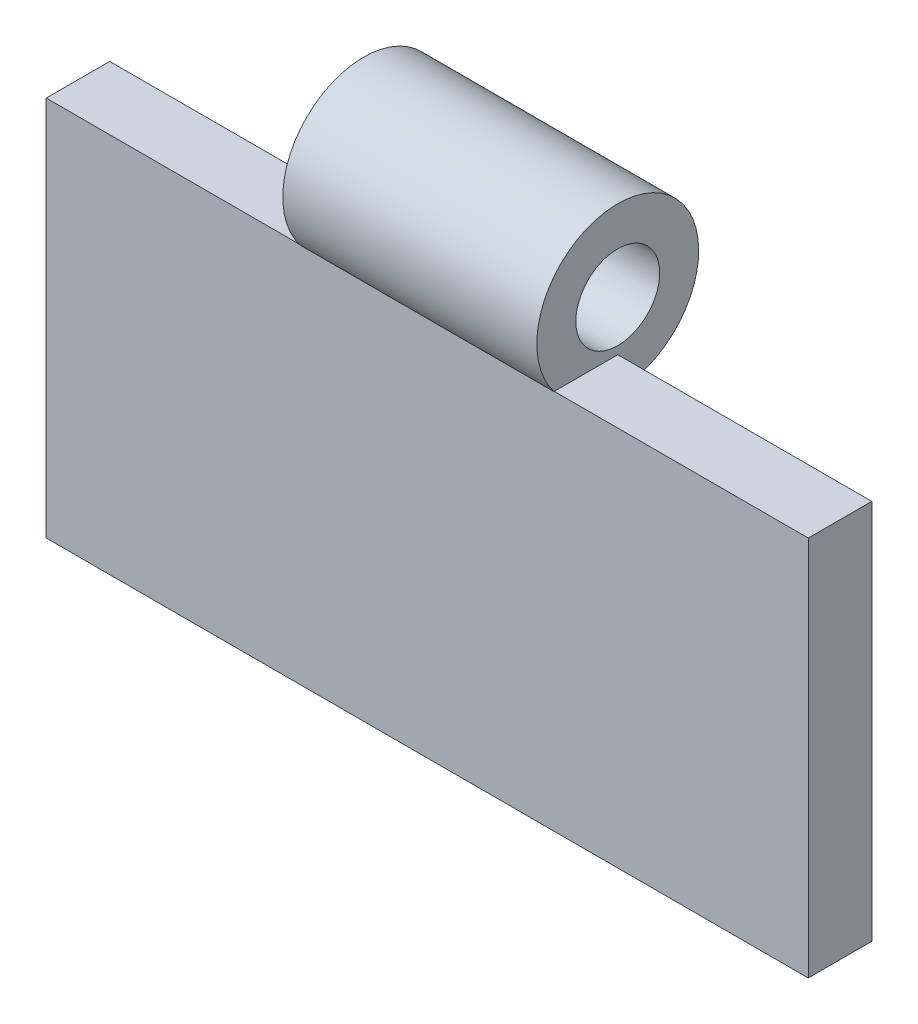
ISO-10303-21;
HEADER;
FILE_DESCRIPTION(('STEP AP214'),'2;1');
FILE_NAME('part.step','',(''),(''),'','','');
FILE_SCHEMA(('AUTOMOTIVE_DESIGN { 1 0 10303 214 1 1 1 1 }'));
ENDSEC;
DATA;
#1=APPLICATION_CONTEXT('core data for automotive mechanical design processes');
#2=APPLICATION_PROTOCOL_DEFINITION('international standard','automotive_design',2000,#1);
#3=PRODUCT_CONTEXT('',#1,'mechanical');
#4=PRODUCT('Part','Part','',(#3));
#5=PRODUCT_RELATED_PRODUCT_CATEGORY('part','',(#4));
#6=PRODUCT_DEFINITION_FORMATION('','',#4);
#7=PRODUCT_DEFINITION_CONTEXT('part definition',#1,'design');
#8=PRODUCT_DEFINITION('design','',#6,#7);
#9=PRODUCT_DEFINITION_SHAPE('','',#8);
#10=(LENGTH_UNIT() NAMED_UNIT(*) SI_UNIT(.MILLI.,.METRE.));
#11=(NAMED_UNIT(*) PLANE_ANGLE_UNIT() SI_UNIT($,.RADIAN.));
#12=(NAMED_UNIT(*) SI_UNIT($,.STERADIAN.) SOLID_ANGLE_UNIT());
#13=UNCERTAINTY_MEASURE_WITH_UNIT(LENGTH_MEASURE(1.E-05),#10,'distance_accuracy_value','');
#14=(GEOMETRIC_REPRESENTATION_CONTEXT(3) GLOBAL_UNCERTAINTY_ASSIGNED_CONTEXT((#13)) GLOBAL_UNIT_ASSIGNED_CONTEXT((#10,
#11,#12)) REPRESENTATION_CONTEXT('',''));
#15=CARTESIAN_POINT('',(0.,0.,0.));
#16=DIRECTION('',(0.,0.,1.));
#17=DIRECTION('',(1.,0.,0.));
#18=AXIS2_PLACEMENT_3D('',#15,#16,#17);
#19=CARTESIAN_POINT('',(0.,0.,5.));
#20=DIRECTION('',(0.,-1.,0.));
#21=DIRECTION('',(0.,0.,-1.));
#22=AXIS2_PLACEMENT_3D('',#19,#20,#21);
#23=PLANE('',#22);
#24=DIRECTION('',(0.,0.,-1.));
#25=VECTOR('',#24,1.);
#26=CARTESIAN_POINT('',(40.,0.,5.));
#27=LINE('',#26,#25);
#28=CARTESIAN_POINT('',(40.,0.,5.));
#29=VERTEX_POINT('',#28);
#30=CARTESIAN_POINT('',(40.,0.,0.));
#31=VERTEX_POINT('',#30);
#32=EDGE_CURVE('E115',#29,#31,#27,.T.);
#33=ORIENTED_EDGE('',*,*,#32,.F.);
#34=DIRECTION('',(-1.,0.,0.));
#35=VECTOR('',#34,1.);
#36=CARTESIAN_POINT('',(0.,0.,5.));
#37=LINE('',#36,#35);
#38=CARTESIAN_POINT('',(60.,0.,5.));
#39=VERTEX_POINT('',#38);
#40=EDGE_CURVE('E145',#39,#29,#37,.T.);
#41=ORIENTED_EDGE('',*,*,#40,.F.);
#42=DIRECTION('',(0.,0.,-1.));
#43=VECTOR('',#42,1.);
#44=CARTESIAN_POINT('',(60.,0.,5.));
#45=LINE('',#44,#43);
#46=CARTESIAN_POINT('',(60.,0.,0.));
#47=VERTEX_POINT('',#46);
#48=EDGE_CURVE('E154',#39,#47,#45,.T.);
#49=ORIENTED_EDGE('',*,*,#48,.T.);
#50=DIRECTION('',(-1.,0.,0.));
#51=VECTOR('',#50,1.);
#52=CARTESIAN_POINT('',(0.,0.,0.));
#53=LINE('',#52,#51);
#54=EDGE_CURVE('E141',#47,#31,#53,.T.);
#55=ORIENTED_EDGE('',*,*,#54,.T.);
#56=EDGE_LOOP('',(#33,#41,#49,#55));
#57=FACE_BOUND('',#56,.T.);
#58=ADVANCED_FACE('F39',(#57),#23,.F.);
#59=CARTESIAN_POINT('',(0.,0.,5.));
#60=DIRECTION('',(0.,0.,1.));
#61=DIRECTION('',(1.,0.,0.));
#62=AXIS2_PLACEMENT_3D('',#59,#60,#61);
#63=PLANE('',#62);
#64=ORIENTED_EDGE('',*,*,#40,.T.);
#65=DIRECTION('',(0.,-1.,0.));
#66=VECTOR('',#65,1.);
#67=CARTESIAN_POINT('',(40.,0.,5.));
#68=LINE('',#67,#66);
#69=CARTESIAN_POINT('',(40.,-0.0302785370189405,5.));
#70=VERTEX_POINT('',#69);
#71=EDGE_CURVE('E130',#29,#70,#68,.T.);
#72=ORIENTED_EDGE('',*,*,#71,.T.);
#73=DIRECTION('',(-1.,0.,0.));
#74=VECTOR('',#73,1.);
#75=CARTESIAN_POINT('',(40.,-0.0302785370189405,5.));
#76=LINE('',#75,#74);
#77=CARTESIAN_POINT('',(20.,-0.0302785370189405,5.));
#78=VERTEX_POINT('',#77);
#79=EDGE_CURVE('E120',#78,#70,#76,.F.);
#80=ORIENTED_EDGE('',*,*,#79,.F.);
#81=DIRECTION('',(0.,-1.,0.));
#82=VECTOR('',#81,1.);
#83=CARTESIAN_POINT('',(20.,0.,5.));
#84=LINE('',#83,#82);
#85=CARTESIAN_POINT('',(20.,0.,5.));
#86=VERTEX_POINT('',#85);
#87=EDGE_CURVE('E111',#86,#78,#84,.T.);
#88=ORIENTED_EDGE('',*,*,#87,.F.);
#89=CARTESIAN_POINT('',(0.,0.,5.));
#90=VERTEX_POINT('',#89);
#91=EDGE_CURVE('E63',#86,#90,#37,.T.);
#92=ORIENTED_EDGE('',*,*,#91,.T.);
#93=DIRECTION('',(0.,-1.,0.));
#94=VECTOR('',#93,1.);
#95=CARTESIAN_POINT('',(0.,0.,5.));
#96=LINE('',#95,#94);
#97=CARTESIAN_POINT('',(0.,-30.,5.));
#98=VERTEX_POINT('',#97);
#99=EDGE_CURVE('E139',#90,#98,#96,.T.);
#100=ORIENTED_EDGE('',*,*,#99,.T.);
#101=DIRECTION('',(1.,0.,0.));
#102=VECTOR('',#101,1.);
#103=CARTESIAN_POINT('',(0.,-30.,5.));
#104=LINE('',#103,#102);
#105=CARTESIAN_POINT('',(60.,-30.,5.));
#106=VERTEX_POINT('',#105);
#107=EDGE_CURVE('E93',#98,#106,#104,.T.);
#108=ORIENTED_EDGE('',*,*,#107,.T.);
#109=DIRECTION('',(0.,1.,0.));
#110=VECTOR('',#109,1.);
#111=CARTESIAN_POINT('',(60.,0.,5.));
#112=LINE('',#111,#110);
#113=EDGE_CURVE('E143',#106,#39,#112,.T.);
#114=ORIENTED_EDGE('',*,*,#113,.T.);
#115=EDGE_LOOP('',(#64,#72,#80,#88,#92,#100,#108,#114));
#116=FACE_BOUND('',#115,.T.);
#117=ADVANCED_FACE('F129',(#116),#63,.T.);
#118=CARTESIAN_POINT('',(0.,0.,0.));
#119=DIRECTION('',(0.,0.,1.));
#120=DIRECTION('',(1.,0.,0.));
#121=AXIS2_PLACEMENT_3D('',#118,#119,#120);
#122=PLANE('',#121);
#123=DIRECTION('',(0.,-1.,0.));
#124=VECTOR('',#123,1.);
#125=CARTESIAN_POINT('',(40.,0.,0.));
#126=LINE('',#125,#124);
#127=CARTESIAN_POINT('',(40.,-2.45052575586928,0.));
#128=VERTEX_POINT('',#127);
#129=EDGE_CURVE('E12',#31,#128,#126,.T.);
#130=ORIENTED_EDGE('',*,*,#129,.F.);
#131=ORIENTED_EDGE('',*,*,#54,.F.);
#132=DIRECTION('',(0.,1.,0.));
#133=VECTOR('',#132,1.);
#134=CARTESIAN_POINT('',(60.,0.,0.));
#135=LINE('',#134,#133);
#136=CARTESIAN_POINT('',(60.,-30.,0.));
#137=VERTEX_POINT('',#136);
#138=EDGE_CURVE('E149',#137,#47,#135,.T.);
#139=ORIENTED_EDGE('',*,*,#138,.F.);
#140=DIRECTION('',(1.,0.,0.));
#141=VECTOR('',#140,1.);
#142=CARTESIAN_POINT('',(0.,-30.,0.));
#143=LINE('',#142,#141);
#144=CARTESIAN_POINT('',(0.,-30.,0.));
#145=VERTEX_POINT('',#144);
#146=EDGE_CURVE('E134',#145,#137,#143,.T.);
#147=ORIENTED_EDGE('',*,*,#146,.F.);
#148=DIRECTION('',(0.,-1.,0.));
#149=VECTOR('',#148,1.);
#150=CARTESIAN_POINT('',(0.,0.,0.));
#151=LINE('',#150,#149);
#152=CARTESIAN_POINT('',(0.,0.,0.));
#153=VERTEX_POINT('',#152);
#154=EDGE_CURVE('E131',#153,#145,#151,.T.);
#155=ORIENTED_EDGE('',*,*,#154,.F.);
#156=CARTESIAN_POINT('',(20.,0.,0.));
#157=VERTEX_POINT('',#156);
#158=EDGE_CURVE('E85',#157,#153,#53,.T.);
#159=ORIENTED_EDGE('',*,*,#158,.F.);
#160=DIRECTION('',(0.,-1.,0.));
#161=VECTOR('',#160,1.);
#162=CARTESIAN_POINT('',(20.,0.,0.));
#163=LINE('',#162,#161);
#164=CARTESIAN_POINT('',(20.,-2.45052575586928,0.));
#165=VERTEX_POINT('',#164);
#166=EDGE_CURVE('E162',#157,#165,#163,.T.);
#167=ORIENTED_EDGE('',*,*,#166,.T.);
#168=DIRECTION('',(-1.,0.,0.));
#169=VECTOR('',#168,1.);
#170=CARTESIAN_POINT('',(40.,-2.45052575586928,0.));
#171=LINE('',#170,#169);
#172=EDGE_CURVE('E47',#165,#128,#171,.F.);
#173=ORIENTED_EDGE('',*,*,#172,.T.);
#174=EDGE_LOOP('',(#130,#131,#139,#147,#155,#159,#167,#173));
#175=FACE_BOUND('',#174,.T.);
#176=ADVANCED_FACE('F165',(#175),#122,.F.);
#177=CARTESIAN_POINT('',(0.,0.,5.));
#178=DIRECTION('',(1.,0.,0.));
#179=DIRECTION('',(0.,0.,-1.));
#180=AXIS2_PLACEMENT_3D('',#177,#178,#179);
#181=PLANE('',#180);
#182=ORIENTED_EDGE('',*,*,#154,.T.);
#183=DIRECTION('',(0.,0.,-1.));
#184=VECTOR('',#183,1.);
#185=CARTESIAN_POINT('',(0.,-30.,5.));
#186=LINE('',#185,#184);
#187=EDGE_CURVE('E160',#98,#145,#186,.T.);
#188=ORIENTED_EDGE('',*,*,#187,.F.);
#189=ORIENTED_EDGE('',*,*,#99,.F.);
#190=DIRECTION('',(0.,0.,-1.));
#191=VECTOR('',#190,1.);
#192=CARTESIAN_POINT('',(0.,0.,5.));
#193=LINE('',#192,#191);
#194=EDGE_CURVE('E146',#90,#153,#193,.T.);
#195=ORIENTED_EDGE('',*,*,#194,.T.);
#196=EDGE_LOOP('',(#182,#188,#189,#195));
#197=FACE_BOUND('',#196,.T.);
#198=ADVANCED_FACE('F41',(#197),#181,.F.);
#199=CARTESIAN_POINT('',(0.,-30.,5.));
#200=DIRECTION('',(0.,1.,0.));
#201=DIRECTION('',(0.,0.,1.));
#202=AXIS2_PLACEMENT_3D('',#199,#200,#201);
#203=PLANE('',#202);
#204=ORIENTED_EDGE('',*,*,#146,.T.);
#205=DIRECTION('',(0.,0.,-1.));
#206=VECTOR('',#205,1.);
#207=CARTESIAN_POINT('',(60.,-30.,5.));
#208=LINE('',#207,#206);
#209=EDGE_CURVE('E157',#106,#137,#208,.T.);
#210=ORIENTED_EDGE('',*,*,#209,.F.);
#211=ORIENTED_EDGE('',*,*,#107,.F.);
#212=ORIENTED_EDGE('',*,*,#187,.T.);
#213=EDGE_LOOP('',(#204,#210,#211,#212));
#214=FACE_BOUND('',#213,.T.);
#215=ADVANCED_FACE('F183',(#214),#203,.F.);
#216=CARTESIAN_POINT('',(60.,0.,5.));
#217=DIRECTION('',(-1.,0.,0.));
#218=DIRECTION('',(0.,-1.,0.));
#219=AXIS2_PLACEMENT_3D('',#216,#217,#218);
#220=PLANE('',#219);
#221=ORIENTED_EDGE('',*,*,#138,.T.);
#222=ORIENTED_EDGE('',*,*,#48,.F.);
#223=ORIENTED_EDGE('',*,*,#113,.F.);
#224=ORIENTED_EDGE('',*,*,#209,.T.);
#225=EDGE_LOOP('',(#221,#222,#223,#224));
#226=FACE_BOUND('',#225,.T.);
#227=ADVANCED_FACE('F180',(#226),#220,.F.);
#228=ORIENTED_EDGE('',*,*,#91,.F.);
#229=DIRECTION('',(0.,0.,-1.));
#230=VECTOR('',#229,1.);
#231=CARTESIAN_POINT('',(20.,0.,5.));
#232=LINE('',#231,#230);
#233=EDGE_CURVE('E113',#86,#157,#232,.T.);
#234=ORIENTED_EDGE('',*,*,#233,.T.);
#235=ORIENTED_EDGE('',*,*,#158,.T.);
#236=ORIENTED_EDGE('',*,*,#194,.F.);
#237=EDGE_LOOP('',(#228,#234,#235,#236));
#238=FACE_BOUND('',#237,.T.);
#239=ADVANCED_FACE('F168',(#238),#23,.F.);
#240=CARTESIAN_POINT('',(40.,3.92435949552474,0.));
#241=DIRECTION('',(-1.,0.,0.));
#242=DIRECTION('',(0.,0.,1.));
#243=AXIS2_PLACEMENT_3D('',#240,#241,#242);
#244=CYLINDRICAL_SURFACE('',#243,6.37488525139402);
#245=CARTESIAN_POINT('',(20.,3.92435949552474,0.));
#246=DIRECTION('',(-1.,0.,0.));
#247=DIRECTION('',(0.,0.,1.));
#248=AXIS2_PLACEMENT_3D('',#245,#246,#247);
#249=CIRCLE('',#248,6.37488525139402);
#250=EDGE_CURVE('E54',#78,#165,#249,.T.);
#251=ORIENTED_EDGE('',*,*,#250,.F.);
#252=ORIENTED_EDGE('',*,*,#79,.T.);
#253=CARTESIAN_POINT('',(40.,3.92435949552474,0.));
#254=DIRECTION('',(-1.,0.,0.));
#255=DIRECTION('',(0.,0.,1.));
#256=AXIS2_PLACEMENT_3D('',#253,#254,#255);
#257=CIRCLE('',#256,6.37488525139402);
#258=EDGE_CURVE('E124',#70,#128,#257,.T.);
#259=ORIENTED_EDGE('',*,*,#258,.T.);
#260=ORIENTED_EDGE('',*,*,#172,.F.);
#261=EDGE_LOOP('',(#251,#252,#259,#260));
#262=FACE_BOUND('',#261,.T.);
#263=ADVANCED_FACE('F118',(#262),#244,.T.);
#264=CARTESIAN_POINT('',(40.,3.92435949552474,0.));
#265=DIRECTION('',(-1.,0.,0.));
#266=DIRECTION('',(0.,0.,1.));
#267=AXIS2_PLACEMENT_3D('',#264,#265,#266);
#268=PLANE('',#267);
#269=ORIENTED_EDGE('',*,*,#71,.F.);
#270=ORIENTED_EDGE('',*,*,#32,.T.);
#271=ORIENTED_EDGE('',*,*,#129,.T.);
#272=ORIENTED_EDGE('',*,*,#258,.F.);
#273=EDGE_LOOP('',(#269,#270,#271,#272));
#274=FACE_BOUND('',#273,.T.);
#275=CARTESIAN_POINT('',(40.,3.92435949552474,0.));
#276=DIRECTION('',(-1.,0.,0.));
#277=DIRECTION('',(0.,0.,1.));
#278=AXIS2_PLACEMENT_3D('',#275,#276,#277);
#279=CIRCLE('',#278,3.30292672279423);
#280=CARTESIAN_POINT('',(40.,3.92435949552474,3.30292672279423));
#281=VERTEX_POINT('',#280);
#282=EDGE_CURVE('E125',#281,#281,#279,.T.);
#283=ORIENTED_EDGE('',*,*,#282,.T.);
#284=EDGE_LOOP('',(#283));
#285=FACE_BOUND('',#284,.T.);
#286=ADVANCED_FACE('F173',(#274,#285),#268,.F.);
#287=CARTESIAN_POINT('',(20.,3.92435949552474,0.));
#288=DIRECTION('',(-1.,0.,0.));
#289=DIRECTION('',(0.,0.,1.));
#290=AXIS2_PLACEMENT_3D('',#287,#288,#289);
#291=PLANE('',#290);
#292=CARTESIAN_POINT('',(20.,3.92435949552474,0.));
#293=DIRECTION('',(-1.,0.,0.));
#294=DIRECTION('',(0.,0.,1.));
#295=AXIS2_PLACEMENT_3D('',#292,#293,#294);
#296=CIRCLE('',#295,3.30292672279423);
#297=CARTESIAN_POINT('',(20.,3.92435949552474,3.30292672279423));
#298=VERTEX_POINT('',#297);
#299=EDGE_CURVE('E277',#298,#298,#296,.T.);
#300=ORIENTED_EDGE('',*,*,#299,.F.);
#301=EDGE_LOOP('',(#300));
#302=FACE_BOUND('',#301,.T.);
#303=ORIENTED_EDGE('',*,*,#233,.F.);
#304=ORIENTED_EDGE('',*,*,#87,.T.);
#305=ORIENTED_EDGE('',*,*,#250,.T.);
#306=ORIENTED_EDGE('',*,*,#166,.F.);
#307=EDGE_LOOP('',(#303,#304,#305,#306));
#308=FACE_BOUND('',#307,.T.);
#309=ADVANCED_FACE('F112',(#302,#308),#291,.T.);
#310=CARTESIAN_POINT('',(40.,3.92435949552474,0.));
#311=DIRECTION('',(-1.,0.,0.));
#312=DIRECTION('',(0.,0.,1.));
#313=AXIS2_PLACEMENT_3D('',#310,#311,#312);
#314=CYLINDRICAL_SURFACE('',#313,3.30292672279423);
#315=ORIENTED_EDGE('',*,*,#282,.F.);
#316=EDGE_LOOP('',(#315));
#317=FACE_BOUND('',#316,.T.);
#318=ORIENTED_EDGE('',*,*,#299,.T.);
#319=EDGE_LOOP('',(#318));
#320=FACE_BOUND('',#319,.T.);
#321=ADVANCED_FACE('F257',(#317,#320),#314,.F.);
#322=CLOSED_SHELL('',(#58,#117,#176,#198,#215,#227,#239,#263,#286,#309,#321));
#323=MANIFOLD_SOLID_BREP('B2',#322);
#324=ADVANCED_BREP_SHAPE_REPRESENTATION('',(#18,#323),#14);
#325=SHAPE_DEFINITION_REPRESENTATION(#9,#324);
ENDSEC;
END-ISO-10303-21;
